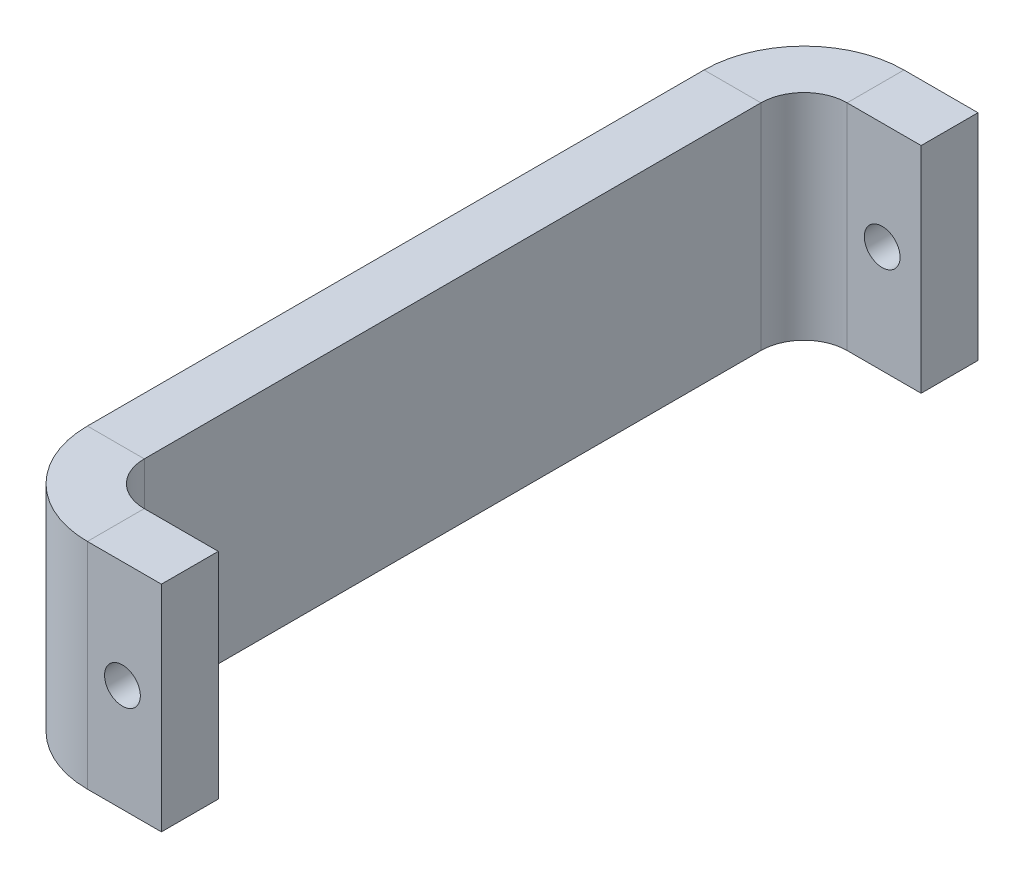
ISO-10303-21;
HEADER;
FILE_DESCRIPTION(('STEP AP214'),'2;1');
FILE_NAME('part.step','',(''),(''),'','','');
FILE_SCHEMA(('AUTOMOTIVE_DESIGN { 1 0 10303 214 1 1 1 1 }'));
ENDSEC;
DATA;
#1=APPLICATION_CONTEXT('core data for automotive mechanical design processes');
#2=APPLICATION_PROTOCOL_DEFINITION('international standard','automotive_design',2000,#1);
#3=PRODUCT_CONTEXT('',#1,'mechanical');
#4=PRODUCT('Part','Part','',(#3));
#5=PRODUCT_RELATED_PRODUCT_CATEGORY('part','',(#4));
#6=PRODUCT_DEFINITION_FORMATION('','',#4);
#7=PRODUCT_DEFINITION_CONTEXT('part definition',#1,'design');
#8=PRODUCT_DEFINITION('design','',#6,#7);
#9=PRODUCT_DEFINITION_SHAPE('','',#8);
#10=(LENGTH_UNIT() NAMED_UNIT(*) SI_UNIT(.MILLI.,.METRE.));
#11=(NAMED_UNIT(*) PLANE_ANGLE_UNIT() SI_UNIT($,.RADIAN.));
#12=(NAMED_UNIT(*) SI_UNIT($,.STERADIAN.) SOLID_ANGLE_UNIT());
#13=UNCERTAINTY_MEASURE_WITH_UNIT(LENGTH_MEASURE(1.E-05),#10,'distance_accuracy_value','');
#14=(GEOMETRIC_REPRESENTATION_CONTEXT(3) GLOBAL_UNCERTAINTY_ASSIGNED_CONTEXT((#13)) GLOBAL_UNIT_ASSIGNED_CONTEXT((#10,
#11,#12)) REPRESENTATION_CONTEXT('',''));
#15=CARTESIAN_POINT('',(0.,0.,0.));
#16=DIRECTION('',(0.,0.,1.));
#17=DIRECTION('',(1.,0.,0.));
#18=AXIS2_PLACEMENT_3D('',#15,#16,#17);
#19=CARTESIAN_POINT('',(2.41,-6.,17.245));
#20=DIRECTION('',(0.,-1.,0.));
#21=DIRECTION('',(0.,0.,-1.));
#22=AXIS2_PLACEMENT_3D('',#19,#20,#21);
#23=PLANE('',#22);
#24=DIRECTION('',(-1.,0.,0.));
#25=VECTOR('',#24,1.);
#26=CARTESIAN_POINT('',(-3.18,-6.,17.245));
#27=LINE('',#26,#25);
#28=CARTESIAN_POINT('',(0.,-6.,17.245));
#29=VERTEX_POINT('',#28);
#30=CARTESIAN_POINT('',(-3.18,-6.,17.245));
#31=VERTEX_POINT('',#30);
#32=EDGE_CURVE('E11',#29,#31,#27,.T.);
#33=ORIENTED_EDGE('',*,*,#32,.F.);
#34=CARTESIAN_POINT('',(2.41,-6.,17.245));
#35=DIRECTION('',(0.,-1.,0.));
#36=DIRECTION('',(0.,0.,-1.));
#37=AXIS2_PLACEMENT_3D('',#34,#35,#36);
#38=CIRCLE('',#37,2.41);
#39=CARTESIAN_POINT('',(2.41000000000001,-6.,19.655));
#40=VERTEX_POINT('',#39);
#41=EDGE_CURVE('E100',#29,#40,#38,.F.);
#42=ORIENTED_EDGE('',*,*,#41,.T.);
#43=DIRECTION('',(0.,0.,1.));
#44=VECTOR('',#43,1.);
#45=CARTESIAN_POINT('',(2.41000000000001,-6.,22.835));
#46=LINE('',#45,#44);
#47=CARTESIAN_POINT('',(2.41000000000001,-6.,22.835));
#48=VERTEX_POINT('',#47);
#49=EDGE_CURVE('E48',#40,#48,#46,.T.);
#50=ORIENTED_EDGE('',*,*,#49,.T.);
#51=CARTESIAN_POINT('',(2.41,-6.,17.245));
#52=DIRECTION('',(0.,1.,0.));
#53=DIRECTION('',(1.,0.,0.));
#54=AXIS2_PLACEMENT_3D('',#51,#52,#53);
#55=CIRCLE('',#54,5.59);
#56=EDGE_CURVE('E103',#31,#48,#55,.T.);
#57=ORIENTED_EDGE('',*,*,#56,.F.);
#58=EDGE_LOOP('',(#33,#42,#50,#57));
#59=FACE_BOUND('',#58,.T.);
#60=ADVANCED_FACE('F38',(#59),#23,.T.);
#61=CARTESIAN_POINT('',(2.41000000000001,-6.,22.835));
#62=DIRECTION('',(0.,1.,0.));
#63=DIRECTION('',(1.,0.,0.));
#64=AXIS2_PLACEMENT_3D('',#61,#62,#63);
#65=PLANE('',#64);
#66=ORIENTED_EDGE('',*,*,#49,.F.);
#67=DIRECTION('',(-1.,0.,0.));
#68=VECTOR('',#67,1.);
#69=CARTESIAN_POINT('',(2.41,-6.,19.655));
#70=LINE('',#69,#68);
#71=CARTESIAN_POINT('',(6.55,-6.,19.655));
#72=VERTEX_POINT('',#71);
#73=EDGE_CURVE('E148',#40,#72,#70,.F.);
#74=ORIENTED_EDGE('',*,*,#73,.T.);
#75=DIRECTION('',(0.,0.,1.));
#76=VECTOR('',#75,1.);
#77=CARTESIAN_POINT('',(6.55000000000001,-6.,22.835));
#78=LINE('',#77,#76);
#79=CARTESIAN_POINT('',(6.55000000000001,-6.,22.835));
#80=VERTEX_POINT('',#79);
#81=EDGE_CURVE('E170',#72,#80,#78,.T.);
#82=ORIENTED_EDGE('',*,*,#81,.T.);
#83=DIRECTION('',(1.,0.,0.));
#84=VECTOR('',#83,1.);
#85=CARTESIAN_POINT('',(2.41000000000001,-6.,22.835));
#86=LINE('',#85,#84);
#87=EDGE_CURVE('E191',#48,#80,#86,.T.);
#88=ORIENTED_EDGE('',*,*,#87,.F.);
#89=EDGE_LOOP('',(#66,#74,#82,#88));
#90=FACE_BOUND('',#89,.T.);
#91=ADVANCED_FACE('F192',(#90),#65,.F.);
#92=CARTESIAN_POINT('',(6.55000000000001,6.,22.835));
#93=DIRECTION('',(1.,0.,0.));
#94=DIRECTION('',(0.,-1.,0.));
#95=AXIS2_PLACEMENT_3D('',#92,#93,#94);
#96=PLANE('',#95);
#97=ORIENTED_EDGE('',*,*,#81,.F.);
#98=DIRECTION('',(0.,1.,0.));
#99=VECTOR('',#98,1.);
#100=CARTESIAN_POINT('',(6.55,6.,19.655));
#101=LINE('',#100,#99);
#102=CARTESIAN_POINT('',(6.55,6.,19.655));
#103=VERTEX_POINT('',#102);
#104=EDGE_CURVE('E257',#103,#72,#101,.F.);
#105=ORIENTED_EDGE('',*,*,#104,.F.);
#106=DIRECTION('',(0.,0.,1.));
#107=VECTOR('',#106,1.);
#108=CARTESIAN_POINT('',(6.55000000000001,6.,22.835));
#109=LINE('',#108,#107);
#110=CARTESIAN_POINT('',(6.55000000000001,6.,22.835));
#111=VERTEX_POINT('',#110);
#112=EDGE_CURVE('E167',#103,#111,#109,.T.);
#113=ORIENTED_EDGE('',*,*,#112,.T.);
#114=DIRECTION('',(0.,-1.,0.));
#115=VECTOR('',#114,1.);
#116=CARTESIAN_POINT('',(6.55000000000001,6.,22.835));
#117=LINE('',#116,#115);
#118=EDGE_CURVE('E196',#111,#80,#117,.T.);
#119=ORIENTED_EDGE('',*,*,#118,.T.);
#120=EDGE_LOOP('',(#97,#105,#113,#119));
#121=FACE_BOUND('',#120,.T.);
#122=ADVANCED_FACE('F264',(#121),#96,.T.);
#123=CARTESIAN_POINT('',(2.41000000000001,6.,22.835));
#124=DIRECTION('',(0.,1.,0.));
#125=DIRECTION('',(1.,0.,0.));
#126=AXIS2_PLACEMENT_3D('',#123,#124,#125);
#127=PLANE('',#126);
#128=ORIENTED_EDGE('',*,*,#112,.F.);
#129=DIRECTION('',(-1.,0.,0.));
#130=VECTOR('',#129,1.);
#131=CARTESIAN_POINT('',(2.41,6.,19.655));
#132=LINE('',#131,#130);
#133=CARTESIAN_POINT('',(2.41,6.,19.655));
#134=VERTEX_POINT('',#133);
#135=EDGE_CURVE('E137',#134,#103,#132,.F.);
#136=ORIENTED_EDGE('',*,*,#135,.F.);
#137=DIRECTION('',(0.,0.,1.));
#138=VECTOR('',#137,1.);
#139=CARTESIAN_POINT('',(2.41000000000001,6.,22.835));
#140=LINE('',#139,#138);
#141=CARTESIAN_POINT('',(2.41000000000001,6.,22.835));
#142=VERTEX_POINT('',#141);
#143=EDGE_CURVE('E164',#134,#142,#140,.T.);
#144=ORIENTED_EDGE('',*,*,#143,.T.);
#145=DIRECTION('',(1.,0.,0.));
#146=VECTOR('',#145,1.);
#147=CARTESIAN_POINT('',(2.41000000000001,6.,22.835));
#148=LINE('',#147,#146);
#149=EDGE_CURVE('E202',#142,#111,#148,.T.);
#150=ORIENTED_EDGE('',*,*,#149,.T.);
#151=EDGE_LOOP('',(#128,#136,#144,#150));
#152=FACE_BOUND('',#151,.T.);
#153=ADVANCED_FACE('F338',(#152),#127,.T.);
#154=CARTESIAN_POINT('',(2.41,6.,17.245));
#155=DIRECTION('',(0.,-1.,0.));
#156=DIRECTION('',(0.,0.,-1.));
#157=AXIS2_PLACEMENT_3D('',#154,#155,#156);
#158=PLANE('',#157);
#159=ORIENTED_EDGE('',*,*,#143,.F.);
#160=CARTESIAN_POINT('',(2.41,6.,17.245));
#161=DIRECTION('',(0.,-1.,0.));
#162=DIRECTION('',(0.,0.,-1.));
#163=AXIS2_PLACEMENT_3D('',#160,#161,#162);
#164=CIRCLE('',#163,2.41);
#165=CARTESIAN_POINT('',(0.,6.,17.245));
#166=VERTEX_POINT('',#165);
#167=EDGE_CURVE('E129',#166,#134,#164,.F.);
#168=ORIENTED_EDGE('',*,*,#167,.F.);
#169=DIRECTION('',(-1.,0.,0.));
#170=VECTOR('',#169,1.);
#171=CARTESIAN_POINT('',(-3.18,6.,17.245));
#172=LINE('',#171,#170);
#173=CARTESIAN_POINT('',(-3.18,6.,17.245));
#174=VERTEX_POINT('',#173);
#175=EDGE_CURVE('E161',#166,#174,#172,.T.);
#176=ORIENTED_EDGE('',*,*,#175,.T.);
#177=CARTESIAN_POINT('',(2.41,6.,17.245));
#178=DIRECTION('',(0.,1.,0.));
#179=DIRECTION('',(1.,0.,0.));
#180=AXIS2_PLACEMENT_3D('',#177,#178,#179);
#181=CIRCLE('',#180,5.59);
#182=EDGE_CURVE('E187',#174,#142,#181,.T.);
#183=ORIENTED_EDGE('',*,*,#182,.T.);
#184=EDGE_LOOP('',(#159,#168,#176,#183));
#185=FACE_BOUND('',#184,.T.);
#186=ADVANCED_FACE('F340',(#185),#158,.F.);
#187=CARTESIAN_POINT('',(-3.18000000000001,6.,-17.245));
#188=DIRECTION('',(0.,1.,0.));
#189=DIRECTION('',(0.,0.,1.));
#190=AXIS2_PLACEMENT_3D('',#187,#188,#189);
#191=PLANE('',#190);
#192=ORIENTED_EDGE('',*,*,#175,.F.);
#193=DIRECTION('',(0.,0.,-1.));
#194=VECTOR('',#193,1.);
#195=CARTESIAN_POINT('',(0.,6.,-17.245));
#196=LINE('',#195,#194);
#197=CARTESIAN_POINT('',(0.,6.,-17.245));
#198=VERTEX_POINT('',#197);
#199=EDGE_CURVE('E119',#198,#166,#196,.F.);
#200=ORIENTED_EDGE('',*,*,#199,.F.);
#201=DIRECTION('',(-1.,0.,0.));
#202=VECTOR('',#201,1.);
#203=CARTESIAN_POINT('',(-3.18000000000001,6.,-17.245));
#204=LINE('',#203,#202);
#205=CARTESIAN_POINT('',(-3.18000000000001,6.,-17.245));
#206=VERTEX_POINT('',#205);
#207=EDGE_CURVE('E158',#198,#206,#204,.T.);
#208=ORIENTED_EDGE('',*,*,#207,.T.);
#209=DIRECTION('',(0.,0.,1.));
#210=VECTOR('',#209,1.);
#211=CARTESIAN_POINT('',(-3.18000000000001,6.,-17.245));
#212=LINE('',#211,#210);
#213=EDGE_CURVE('E211',#206,#174,#212,.T.);
#214=ORIENTED_EDGE('',*,*,#213,.T.);
#215=EDGE_LOOP('',(#192,#200,#208,#214));
#216=FACE_BOUND('',#215,.T.);
#217=ADVANCED_FACE('F343',(#216),#191,.T.);
#218=CARTESIAN_POINT('',(2.40999999999999,6.,-17.245));
#219=DIRECTION('',(0.,-1.,0.));
#220=DIRECTION('',(0.,0.,-1.));
#221=AXIS2_PLACEMENT_3D('',#218,#219,#220);
#222=PLANE('',#221);
#223=ORIENTED_EDGE('',*,*,#207,.F.);
#224=CARTESIAN_POINT('',(2.40999999999999,6.,-17.245));
#225=DIRECTION('',(0.,-1.,0.));
#226=DIRECTION('',(0.,0.,-1.));
#227=AXIS2_PLACEMENT_3D('',#224,#225,#226);
#228=CIRCLE('',#227,2.41);
#229=CARTESIAN_POINT('',(2.40999999999999,6.,-19.655));
#230=VERTEX_POINT('',#229);
#231=EDGE_CURVE('E244',#230,#198,#228,.F.);
#232=ORIENTED_EDGE('',*,*,#231,.F.);
#233=DIRECTION('',(0.,0.,-1.));
#234=VECTOR('',#233,1.);
#235=CARTESIAN_POINT('',(2.40999999999999,6.,-22.835));
#236=LINE('',#235,#234);
#237=CARTESIAN_POINT('',(2.40999999999999,6.,-22.835));
#238=VERTEX_POINT('',#237);
#239=EDGE_CURVE('E155',#230,#238,#236,.T.);
#240=ORIENTED_EDGE('',*,*,#239,.T.);
#241=CARTESIAN_POINT('',(2.40999999999999,6.,-17.245));
#242=DIRECTION('',(0.,1.,0.));
#243=DIRECTION('',(1.,0.,0.));
#244=AXIS2_PLACEMENT_3D('',#241,#242,#243);
#245=CIRCLE('',#244,5.59);
#246=EDGE_CURVE('E234',#238,#206,#245,.T.);
#247=ORIENTED_EDGE('',*,*,#246,.T.);
#248=EDGE_LOOP('',(#223,#232,#240,#247));
#249=FACE_BOUND('',#248,.T.);
#250=ADVANCED_FACE('F416',(#249),#222,.F.);
#251=CARTESIAN_POINT('',(6.54999999999999,6.,-22.835));
#252=DIRECTION('',(0.,1.,0.));
#253=DIRECTION('',(-1.,0.,0.));
#254=AXIS2_PLACEMENT_3D('',#251,#252,#253);
#255=PLANE('',#254);
#256=ORIENTED_EDGE('',*,*,#239,.F.);
#257=DIRECTION('',(1.,0.,0.));
#258=VECTOR('',#257,1.);
#259=CARTESIAN_POINT('',(6.54999999999999,6.,-19.655));
#260=LINE('',#259,#258);
#261=CARTESIAN_POINT('',(6.54999999999999,6.,-19.655));
#262=VERTEX_POINT('',#261);
#263=EDGE_CURVE('E240',#262,#230,#260,.F.);
#264=ORIENTED_EDGE('',*,*,#263,.F.);
#265=DIRECTION('',(0.,0.,-1.));
#266=VECTOR('',#265,1.);
#267=CARTESIAN_POINT('',(6.54999999999999,6.,-22.835));
#268=LINE('',#267,#266);
#269=CARTESIAN_POINT('',(6.54999999999999,6.,-22.835));
#270=VERTEX_POINT('',#269);
#271=EDGE_CURVE('E153',#262,#270,#268,.T.);
#272=ORIENTED_EDGE('',*,*,#271,.T.);
#273=DIRECTION('',(-1.,0.,0.));
#274=VECTOR('',#273,1.);
#275=CARTESIAN_POINT('',(6.54999999999999,6.,-22.835));
#276=LINE('',#275,#274);
#277=EDGE_CURVE('E226',#270,#238,#276,.T.);
#278=ORIENTED_EDGE('',*,*,#277,.T.);
#279=EDGE_LOOP('',(#256,#264,#272,#278));
#280=FACE_BOUND('',#279,.T.);
#281=ADVANCED_FACE('F317',(#280),#255,.T.);
#282=CARTESIAN_POINT('',(6.54999999999999,6.,-22.835));
#283=DIRECTION('',(-1.,0.,0.));
#284=DIRECTION('',(0.,-1.,0.));
#285=AXIS2_PLACEMENT_3D('',#282,#283,#284);
#286=PLANE('',#285);
#287=ORIENTED_EDGE('',*,*,#271,.F.);
#288=DIRECTION('',(0.,1.,0.));
#289=VECTOR('',#288,1.);
#290=CARTESIAN_POINT('',(6.54999999999999,6.,-19.655));
#291=LINE('',#290,#289);
#292=CARTESIAN_POINT('',(6.54999999999999,-6.,-19.655));
#293=VERTEX_POINT('',#292);
#294=EDGE_CURVE('E245',#262,#293,#291,.F.);
#295=ORIENTED_EDGE('',*,*,#294,.T.);
#296=DIRECTION('',(0.,0.,-1.));
#297=VECTOR('',#296,1.);
#298=CARTESIAN_POINT('',(6.54999999999999,-6.,-22.835));
#299=LINE('',#298,#297);
#300=CARTESIAN_POINT('',(6.54999999999999,-6.,-22.835));
#301=VERTEX_POINT('',#300);
#302=EDGE_CURVE('E56',#293,#301,#299,.T.);
#303=ORIENTED_EDGE('',*,*,#302,.T.);
#304=DIRECTION('',(0.,-1.,0.));
#305=VECTOR('',#304,1.);
#306=CARTESIAN_POINT('',(6.54999999999999,6.,-22.835));
#307=LINE('',#306,#305);
#308=EDGE_CURVE('E229',#270,#301,#307,.T.);
#309=ORIENTED_EDGE('',*,*,#308,.F.);
#310=EDGE_LOOP('',(#287,#295,#303,#309));
#311=FACE_BOUND('',#310,.T.);
#312=ADVANCED_FACE('F314',(#311),#286,.F.);
#313=CARTESIAN_POINT('',(6.54999999999999,-6.,-22.835));
#314=DIRECTION('',(0.,1.,0.));
#315=DIRECTION('',(-1.,0.,0.));
#316=AXIS2_PLACEMENT_3D('',#313,#314,#315);
#317=PLANE('',#316);
#318=ORIENTED_EDGE('',*,*,#302,.F.);
#319=DIRECTION('',(1.,0.,0.));
#320=VECTOR('',#319,1.);
#321=CARTESIAN_POINT('',(6.54999999999999,-6.,-19.655));
#322=LINE('',#321,#320);
#323=CARTESIAN_POINT('',(2.40999999999999,-6.,-19.655));
#324=VERTEX_POINT('',#323);
#325=EDGE_CURVE('E144',#293,#324,#322,.F.);
#326=ORIENTED_EDGE('',*,*,#325,.T.);
#327=DIRECTION('',(0.,0.,-1.));
#328=VECTOR('',#327,1.);
#329=CARTESIAN_POINT('',(2.40999999999999,-6.,-22.835));
#330=LINE('',#329,#328);
#331=CARTESIAN_POINT('',(2.40999999999999,-6.,-22.835));
#332=VERTEX_POINT('',#331);
#333=EDGE_CURVE('E149',#324,#332,#330,.T.);
#334=ORIENTED_EDGE('',*,*,#333,.T.);
#335=DIRECTION('',(-1.,0.,0.));
#336=VECTOR('',#335,1.);
#337=CARTESIAN_POINT('',(6.54999999999999,-6.,-22.835));
#338=LINE('',#337,#336);
#339=EDGE_CURVE('E220',#301,#332,#338,.T.);
#340=ORIENTED_EDGE('',*,*,#339,.F.);
#341=EDGE_LOOP('',(#318,#326,#334,#340));
#342=FACE_BOUND('',#341,.T.);
#343=ADVANCED_FACE('F390',(#342),#317,.F.);
#344=CARTESIAN_POINT('',(2.40999999999999,-6.,-17.245));
#345=DIRECTION('',(0.,-1.,0.));
#346=DIRECTION('',(0.,0.,-1.));
#347=AXIS2_PLACEMENT_3D('',#344,#345,#346);
#348=PLANE('',#347);
#349=ORIENTED_EDGE('',*,*,#333,.F.);
#350=CARTESIAN_POINT('',(2.40999999999999,-6.,-17.245));
#351=DIRECTION('',(0.,-1.,0.));
#352=DIRECTION('',(0.,0.,-1.));
#353=AXIS2_PLACEMENT_3D('',#350,#351,#352);
#354=CIRCLE('',#353,2.41);
#355=CARTESIAN_POINT('',(0.,-6.,-17.245));
#356=VERTEX_POINT('',#355);
#357=EDGE_CURVE('E242',#324,#356,#354,.F.);
#358=ORIENTED_EDGE('',*,*,#357,.T.);
#359=DIRECTION('',(-1.,0.,0.));
#360=VECTOR('',#359,1.);
#361=CARTESIAN_POINT('',(-3.18000000000001,-6.,-17.245));
#362=LINE('',#361,#360);
#363=CARTESIAN_POINT('',(-3.18000000000001,-6.,-17.245));
#364=VERTEX_POINT('',#363);
#365=EDGE_CURVE('E42',#356,#364,#362,.T.);
#366=ORIENTED_EDGE('',*,*,#365,.T.);
#367=CARTESIAN_POINT('',(2.40999999999999,-6.,-17.245));
#368=DIRECTION('',(0.,1.,0.));
#369=DIRECTION('',(1.,0.,0.));
#370=AXIS2_PLACEMENT_3D('',#367,#368,#369);
#371=CIRCLE('',#370,5.59);
#372=EDGE_CURVE('E231',#332,#364,#371,.T.);
#373=ORIENTED_EDGE('',*,*,#372,.F.);
#374=EDGE_LOOP('',(#349,#358,#366,#373));
#375=FACE_BOUND('',#374,.T.);
#376=ADVANCED_FACE('F275',(#375),#348,.T.);
#377=CARTESIAN_POINT('',(4.37000000000003,0.,22.835));
#378=DIRECTION('',(0.,0.,-1.));
#379=DIRECTION('',(-1.,0.,0.));
#380=AXIS2_PLACEMENT_3D('',#377,#378,#379);
#381=CYLINDRICAL_SURFACE('',#380,1.);
#382=CARTESIAN_POINT('',(4.37000000000003,0.,22.835));
#383=DIRECTION('',(0.,0.,-1.));
#384=DIRECTION('',(-1.,0.,0.));
#385=AXIS2_PLACEMENT_3D('',#382,#383,#384);
#386=CIRCLE('',#385,1.);
#387=CARTESIAN_POINT('',(3.37000000000003,0.,22.835));
#388=VERTEX_POINT('',#387);
#389=EDGE_CURVE('E197',#388,#388,#386,.T.);
#390=ORIENTED_EDGE('',*,*,#389,.F.);
#391=EDGE_LOOP('',(#390));
#392=FACE_BOUND('',#391,.T.);
#393=CARTESIAN_POINT('',(4.37000000000002,0.,19.655));
#394=DIRECTION('',(0.,0.,-1.));
#395=DIRECTION('',(-1.,0.,0.));
#396=AXIS2_PLACEMENT_3D('',#393,#394,#395);
#397=CIRCLE('',#396,1.);
#398=CARTESIAN_POINT('',(3.37000000000002,0.,19.655));
#399=VERTEX_POINT('',#398);
#400=EDGE_CURVE('E145',#399,#399,#397,.T.);
#401=ORIENTED_EDGE('',*,*,#400,.T.);
#402=EDGE_LOOP('',(#401));
#403=FACE_BOUND('',#402,.T.);
#404=ADVANCED_FACE('F40',(#392,#403),#381,.F.);
#405=CARTESIAN_POINT('',(4.37000000000003,0.,-22.835));
#406=DIRECTION('',(0.,0.,1.));
#407=DIRECTION('',(1.,0.,0.));
#408=AXIS2_PLACEMENT_3D('',#405,#406,#407);
#409=CYLINDRICAL_SURFACE('',#408,1.);
#410=CARTESIAN_POINT('',(4.37000000000003,0.,-22.835));
#411=DIRECTION('',(0.,0.,-1.));
#412=DIRECTION('',(-1.,0.,0.));
#413=AXIS2_PLACEMENT_3D('',#410,#411,#412);
#414=CIRCLE('',#413,1.);
#415=CARTESIAN_POINT('',(3.37000000000003,0.,-22.835));
#416=VERTEX_POINT('',#415);
#417=EDGE_CURVE('E217',#416,#416,#414,.T.);
#418=ORIENTED_EDGE('',*,*,#417,.T.);
#419=EDGE_LOOP('',(#418));
#420=FACE_BOUND('',#419,.T.);
#421=CARTESIAN_POINT('',(4.37000000000002,0.,-19.655));
#422=DIRECTION('',(0.,0.,-1.));
#423=DIRECTION('',(-1.,0.,0.));
#424=AXIS2_PLACEMENT_3D('',#421,#422,#423);
#425=CIRCLE('',#424,1.);
#426=CARTESIAN_POINT('',(3.37000000000002,0.,-19.655));
#427=VERTEX_POINT('',#426);
#428=EDGE_CURVE('E141',#427,#427,#425,.T.);
#429=ORIENTED_EDGE('',*,*,#428,.F.);
#430=EDGE_LOOP('',(#429));
#431=FACE_BOUND('',#430,.T.);
#432=ADVANCED_FACE('F274',(#420,#431),#409,.F.);
#433=CARTESIAN_POINT('',(-3.18000000000001,-6.,-17.245));
#434=DIRECTION('',(0.,1.,0.));
#435=DIRECTION('',(0.,0.,1.));
#436=AXIS2_PLACEMENT_3D('',#433,#434,#435);
#437=PLANE('',#436);
#438=DIRECTION('',(0.,0.,-1.));
#439=VECTOR('',#438,1.);
#440=CARTESIAN_POINT('',(0.,-6.,-17.245));
#441=LINE('',#440,#439);
#442=EDGE_CURVE('E116',#356,#29,#441,.F.);
#443=ORIENTED_EDGE('',*,*,#442,.T.);
#444=ORIENTED_EDGE('',*,*,#32,.T.);
#445=DIRECTION('',(0.,0.,1.));
#446=VECTOR('',#445,1.);
#447=CARTESIAN_POINT('',(-3.18000000000001,-6.,-17.245));
#448=LINE('',#447,#446);
#449=EDGE_CURVE('E204',#364,#31,#448,.T.);
#450=ORIENTED_EDGE('',*,*,#449,.F.);
#451=ORIENTED_EDGE('',*,*,#365,.F.);
#452=EDGE_LOOP('',(#443,#444,#450,#451));
#453=FACE_BOUND('',#452,.T.);
#454=ADVANCED_FACE('F133',(#453),#437,.F.);
#455=CARTESIAN_POINT('',(2.40999999999999,6.,-17.245));
#456=DIRECTION('',(0.,-1.,0.));
#457=DIRECTION('',(0.,0.,-1.));
#458=AXIS2_PLACEMENT_3D('',#455,#456,#457);
#459=CYLINDRICAL_SURFACE('',#458,5.59);
#460=ORIENTED_EDGE('',*,*,#372,.T.);
#461=DIRECTION('',(0.,-1.,0.));
#462=VECTOR('',#461,1.);
#463=CARTESIAN_POINT('',(-3.18000000000001,6.,-17.245));
#464=LINE('',#463,#462);
#465=EDGE_CURVE('E188',#206,#364,#464,.T.);
#466=ORIENTED_EDGE('',*,*,#465,.F.);
#467=ORIENTED_EDGE('',*,*,#246,.F.);
#468=DIRECTION('',(0.,-1.,0.));
#469=VECTOR('',#468,1.);
#470=CARTESIAN_POINT('',(2.40999999999999,6.,-22.835));
#471=LINE('',#470,#469);
#472=EDGE_CURVE('E223',#238,#332,#471,.T.);
#473=ORIENTED_EDGE('',*,*,#472,.T.);
#474=EDGE_LOOP('',(#460,#466,#467,#473));
#475=FACE_BOUND('',#474,.T.);
#476=ADVANCED_FACE('F294',(#475),#459,.T.);
#477=CARTESIAN_POINT('',(6.54999999999999,6.,-22.835));
#478=DIRECTION('',(0.,0.,1.));
#479=DIRECTION('',(1.,0.,0.));
#480=AXIS2_PLACEMENT_3D('',#477,#478,#479);
#481=PLANE('',#480);
#482=ORIENTED_EDGE('',*,*,#417,.F.);
#483=EDGE_LOOP('',(#482));
#484=FACE_BOUND('',#483,.T.);
#485=ORIENTED_EDGE('',*,*,#339,.T.);
#486=ORIENTED_EDGE('',*,*,#472,.F.);
#487=ORIENTED_EDGE('',*,*,#277,.F.);
#488=ORIENTED_EDGE('',*,*,#308,.T.);
#489=EDGE_LOOP('',(#485,#486,#487,#488));
#490=FACE_BOUND('',#489,.T.);
#491=ADVANCED_FACE('F321',(#484,#490),#481,.F.);
#492=CARTESIAN_POINT('',(2.41,6.,17.245));
#493=DIRECTION('',(0.,-1.,0.));
#494=DIRECTION('',(0.,0.,-1.));
#495=AXIS2_PLACEMENT_3D('',#492,#493,#494);
#496=CYLINDRICAL_SURFACE('',#495,5.59);
#497=ORIENTED_EDGE('',*,*,#56,.T.);
#498=DIRECTION('',(0.,-1.,0.));
#499=VECTOR('',#498,1.);
#500=CARTESIAN_POINT('',(2.41000000000001,6.,22.835));
#501=LINE('',#500,#499);
#502=EDGE_CURVE('E184',#142,#48,#501,.T.);
#503=ORIENTED_EDGE('',*,*,#502,.F.);
#504=ORIENTED_EDGE('',*,*,#182,.F.);
#505=DIRECTION('',(0.,-1.,0.));
#506=VECTOR('',#505,1.);
#507=CARTESIAN_POINT('',(-3.18,6.,17.245));
#508=LINE('',#507,#506);
#509=EDGE_CURVE('E186',#174,#31,#508,.T.);
#510=ORIENTED_EDGE('',*,*,#509,.T.);
#511=EDGE_LOOP('',(#497,#503,#504,#510));
#512=FACE_BOUND('',#511,.T.);
#513=ADVANCED_FACE('F181',(#512),#496,.T.);
#514=CARTESIAN_POINT('',(-3.18000000000001,6.,-17.245));
#515=DIRECTION('',(1.,0.,0.));
#516=DIRECTION('',(0.,0.,-1.));
#517=AXIS2_PLACEMENT_3D('',#514,#515,#516);
#518=PLANE('',#517);
#519=ORIENTED_EDGE('',*,*,#449,.T.);
#520=ORIENTED_EDGE('',*,*,#509,.F.);
#521=ORIENTED_EDGE('',*,*,#213,.F.);
#522=ORIENTED_EDGE('',*,*,#465,.T.);
#523=EDGE_LOOP('',(#519,#520,#521,#522));
#524=FACE_BOUND('',#523,.T.);
#525=ADVANCED_FACE('F345',(#524),#518,.F.);
#526=CARTESIAN_POINT('',(2.41000000000001,6.,22.835));
#527=DIRECTION('',(0.,0.,-1.));
#528=DIRECTION('',(-1.,0.,0.));
#529=AXIS2_PLACEMENT_3D('',#526,#527,#528);
#530=PLANE('',#529);
#531=ORIENTED_EDGE('',*,*,#389,.T.);
#532=EDGE_LOOP('',(#531));
#533=FACE_BOUND('',#532,.T.);
#534=ORIENTED_EDGE('',*,*,#87,.T.);
#535=ORIENTED_EDGE('',*,*,#118,.F.);
#536=ORIENTED_EDGE('',*,*,#149,.F.);
#537=ORIENTED_EDGE('',*,*,#502,.T.);
#538=EDGE_LOOP('',(#534,#535,#536,#537));
#539=FACE_BOUND('',#538,.T.);
#540=ADVANCED_FACE('F200',(#533,#539),#530,.F.);
#541=CARTESIAN_POINT('',(2.40999999999999,6.,-17.245));
#542=DIRECTION('',(0.,-1.,0.));
#543=DIRECTION('',(0.,0.,-1.));
#544=AXIS2_PLACEMENT_3D('',#541,#542,#543);
#545=CYLINDRICAL_SURFACE('',#544,2.41);
#546=ORIENTED_EDGE('',*,*,#357,.F.);
#547=DIRECTION('',(0.,-1.,0.));
#548=VECTOR('',#547,1.);
#549=CARTESIAN_POINT('',(2.40999999999999,6.,-19.655));
#550=LINE('',#549,#548);
#551=EDGE_CURVE('E238',#230,#324,#550,.T.);
#552=ORIENTED_EDGE('',*,*,#551,.F.);
#553=ORIENTED_EDGE('',*,*,#231,.T.);
#554=DIRECTION('',(0.,1.,0.));
#555=VECTOR('',#554,1.);
#556=CARTESIAN_POINT('',(0.,6.,-17.245));
#557=LINE('',#556,#555);
#558=EDGE_CURVE('E130',#198,#356,#557,.F.);
#559=ORIENTED_EDGE('',*,*,#558,.T.);
#560=EDGE_LOOP('',(#546,#552,#553,#559));
#561=FACE_BOUND('',#560,.T.);
#562=ADVANCED_FACE('F306',(#561),#545,.F.);
#563=CARTESIAN_POINT('',(6.54999999999999,6.,-19.655));
#564=DIRECTION('',(0.,0.,1.));
#565=DIRECTION('',(1.,0.,0.));
#566=AXIS2_PLACEMENT_3D('',#563,#564,#565);
#567=PLANE('',#566);
#568=ORIENTED_EDGE('',*,*,#428,.T.);
#569=EDGE_LOOP('',(#568));
#570=FACE_BOUND('',#569,.T.);
#571=ORIENTED_EDGE('',*,*,#325,.F.);
#572=ORIENTED_EDGE('',*,*,#294,.F.);
#573=ORIENTED_EDGE('',*,*,#263,.T.);
#574=ORIENTED_EDGE('',*,*,#551,.T.);
#575=EDGE_LOOP('',(#571,#572,#573,#574));
#576=FACE_BOUND('',#575,.T.);
#577=ADVANCED_FACE('F303',(#570,#576),#567,.T.);
#578=CARTESIAN_POINT('',(2.41,6.,17.245));
#579=DIRECTION('',(0.,-1.,0.));
#580=DIRECTION('',(0.,0.,-1.));
#581=AXIS2_PLACEMENT_3D('',#578,#579,#580);
#582=CYLINDRICAL_SURFACE('',#581,2.41);
#583=ORIENTED_EDGE('',*,*,#41,.F.);
#584=DIRECTION('',(0.,-1.,0.));
#585=VECTOR('',#584,1.);
#586=CARTESIAN_POINT('',(0.,6.,17.245));
#587=LINE('',#586,#585);
#588=EDGE_CURVE('E113',#166,#29,#587,.T.);
#589=ORIENTED_EDGE('',*,*,#588,.F.);
#590=ORIENTED_EDGE('',*,*,#167,.T.);
#591=DIRECTION('',(0.,1.,0.));
#592=VECTOR('',#591,1.);
#593=CARTESIAN_POINT('',(2.41,6.,19.655));
#594=LINE('',#593,#592);
#595=EDGE_CURVE('E127',#134,#40,#594,.F.);
#596=ORIENTED_EDGE('',*,*,#595,.T.);
#597=EDGE_LOOP('',(#583,#589,#590,#596));
#598=FACE_BOUND('',#597,.T.);
#599=ADVANCED_FACE('F125',(#598),#582,.F.);
#600=CARTESIAN_POINT('',(0.,6.,-17.245));
#601=DIRECTION('',(1.,0.,0.));
#602=DIRECTION('',(0.,0.,-1.));
#603=AXIS2_PLACEMENT_3D('',#600,#601,#602);
#604=PLANE('',#603);
#605=ORIENTED_EDGE('',*,*,#442,.F.);
#606=ORIENTED_EDGE('',*,*,#558,.F.);
#607=ORIENTED_EDGE('',*,*,#199,.T.);
#608=ORIENTED_EDGE('',*,*,#588,.T.);
#609=EDGE_LOOP('',(#605,#606,#607,#608));
#610=FACE_BOUND('',#609,.T.);
#611=ADVANCED_FACE('F114',(#610),#604,.T.);
#612=CARTESIAN_POINT('',(2.41,6.,19.655));
#613=DIRECTION('',(0.,0.,-1.));
#614=DIRECTION('',(-1.,0.,0.));
#615=AXIS2_PLACEMENT_3D('',#612,#613,#614);
#616=PLANE('',#615);
#617=ORIENTED_EDGE('',*,*,#400,.F.);
#618=EDGE_LOOP('',(#617));
#619=FACE_BOUND('',#618,.T.);
#620=ORIENTED_EDGE('',*,*,#73,.F.);
#621=ORIENTED_EDGE('',*,*,#595,.F.);
#622=ORIENTED_EDGE('',*,*,#135,.T.);
#623=ORIENTED_EDGE('',*,*,#104,.T.);
#624=EDGE_LOOP('',(#620,#621,#622,#623));
#625=FACE_BOUND('',#624,.T.);
#626=ADVANCED_FACE('F260',(#619,#625),#616,.T.);
#627=CLOSED_SHELL('',(#60,#91,#122,#153,#186,#217,#250,#281,#312,#343,#376,#404,#432,#454,#476,
#491,#513,#525,#540,#562,#577,#599,#611,#626));
#628=MANIFOLD_SOLID_BREP('B2',#627);
#629=ADVANCED_BREP_SHAPE_REPRESENTATION('',(#18,#628),#14);
#630=SHAPE_DEFINITION_REPRESENTATION(#9,#629);
ENDSEC;
END-ISO-10303-21;
